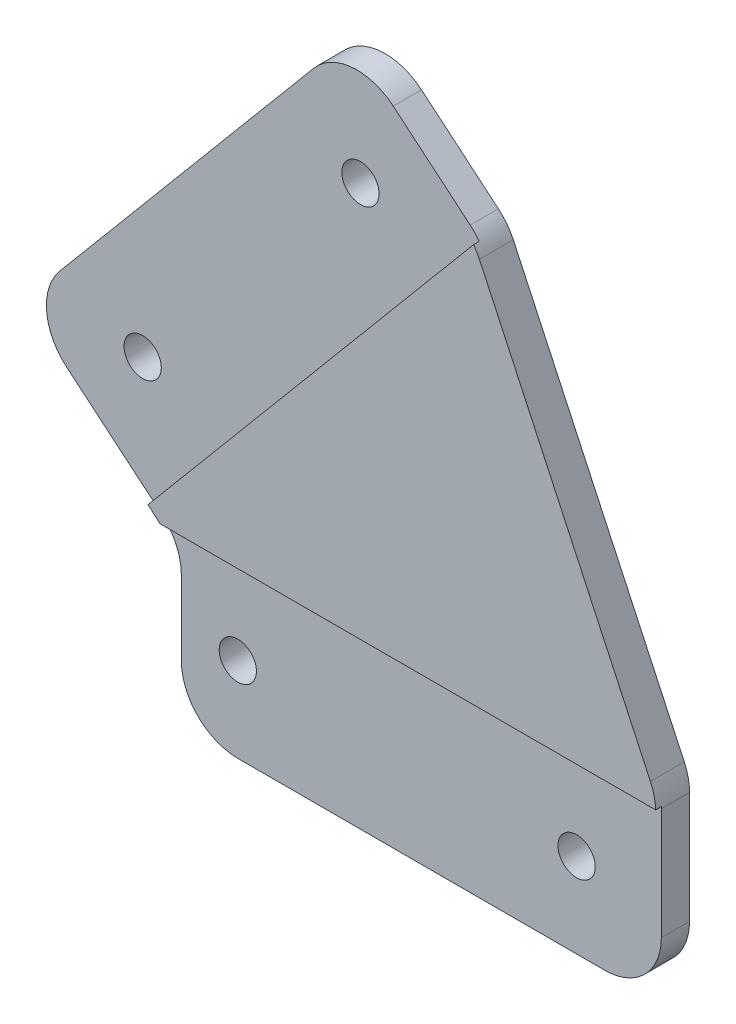
ISO-10303-21;
HEADER;
FILE_DESCRIPTION(('STEP AP214'),'2;1');
FILE_NAME('part.step','',(''),(''),'','','');
FILE_SCHEMA(('AUTOMOTIVE_DESIGN { 1 0 10303 214 1 1 1 1 }'));
ENDSEC;
DATA;
#1=APPLICATION_CONTEXT('core data for automotive mechanical design processes');
#2=APPLICATION_PROTOCOL_DEFINITION('international standard','automotive_design',2000,#1);
#3=PRODUCT_CONTEXT('',#1,'mechanical');
#4=PRODUCT('Part','Part','',(#3));
#5=PRODUCT_RELATED_PRODUCT_CATEGORY('part','',(#4));
#6=PRODUCT_DEFINITION_FORMATION('','',#4);
#7=PRODUCT_DEFINITION_CONTEXT('part definition',#1,'design');
#8=PRODUCT_DEFINITION('design','',#6,#7);
#9=PRODUCT_DEFINITION_SHAPE('','',#8);
#10=(LENGTH_UNIT() NAMED_UNIT(*) SI_UNIT(.MILLI.,.METRE.));
#11=(NAMED_UNIT(*) PLANE_ANGLE_UNIT() SI_UNIT($,.RADIAN.));
#12=(NAMED_UNIT(*) SI_UNIT($,.STERADIAN.) SOLID_ANGLE_UNIT());
#13=UNCERTAINTY_MEASURE_WITH_UNIT(LENGTH_MEASURE(1.E-05),#10,'distance_accuracy_value','');
#14=(GEOMETRIC_REPRESENTATION_CONTEXT(3) GLOBAL_UNCERTAINTY_ASSIGNED_CONTEXT((#13)) GLOBAL_UNIT_ASSIGNED_CONTEXT((#10,
#11,#12)) REPRESENTATION_CONTEXT('',''));
#15=CARTESIAN_POINT('',(0.,0.,0.));
#16=DIRECTION('',(0.,0.,1.));
#17=DIRECTION('',(1.,0.,0.));
#18=AXIS2_PLACEMENT_3D('',#15,#16,#17);
#19=CARTESIAN_POINT('',(0.,0.,3.));
#20=DIRECTION('',(0.642787609686543,0.766044443118975,0.));
#21=DIRECTION('',(-0.766044443118975,0.642787609686543,0.));
#22=AXIS2_PLACEMENT_3D('',#19,#20,#21);
#23=PLANE('',#22);
#24=DIRECTION('',(0.766044443118975,-0.642787609686543,0.));
#25=VECTOR('',#24,1.);
#26=CARTESIAN_POINT('',(0.,0.,3.));
#27=LINE('',#26,#25);
#28=CARTESIAN_POINT('',(0.038302222155933,-0.032139380484332,3.));
#29=VERTEX_POINT('',#28);
#30=CARTESIAN_POINT('',(0.713938048432714,-0.599065153123323,3.));
#31=VERTEX_POINT('',#30);
#32=EDGE_CURVE('E263',#29,#31,#27,.T.);
#33=ORIENTED_EDGE('',*,*,#32,.F.);
#34=DIRECTION('',(0.,0.,-1.));
#35=VECTOR('',#34,1.);
#36=CARTESIAN_POINT('',(0.0383022221559392,-0.0321393804843191,3.));
#37=LINE('',#36,#35);
#38=CARTESIAN_POINT('',(0.0383022221559434,-0.0321393804843154,2.5));
#39=VERTEX_POINT('',#38);
#40=EDGE_CURVE('E311',#29,#39,#37,.T.);
#41=ORIENTED_EDGE('',*,*,#40,.T.);
#42=DIRECTION('',(-0.766044443118975,0.642787609686543,0.));
#43=VECTOR('',#42,1.);
#44=CARTESIAN_POINT('',(0.,0.,2.5));
#45=LINE('',#44,#43);
#46=CARTESIAN_POINT('',(-7.66044443118975,6.42787609686543,2.5));
#47=VERTEX_POINT('',#46);
#48=EDGE_CURVE('E326',#39,#47,#45,.T.);
#49=ORIENTED_EDGE('',*,*,#48,.T.);
#50=DIRECTION('',(0.,0.,-1.));
#51=VECTOR('',#50,1.);
#52=CARTESIAN_POINT('',(-7.66044443118975,6.42787609686543,3.));
#53=LINE('',#52,#51);
#54=CARTESIAN_POINT('',(-7.66044443118975,6.42787609686543,0.));
#55=VERTEX_POINT('',#54);
#56=EDGE_CURVE('E214',#47,#55,#53,.T.);
#57=ORIENTED_EDGE('',*,*,#56,.T.);
#58=DIRECTION('',(0.766044443118975,-0.642787609686543,0.));
#59=VECTOR('',#58,1.);
#60=CARTESIAN_POINT('',(0.,0.,0.));
#61=LINE('',#60,#59);
#62=CARTESIAN_POINT('',(0.713938048432714,-0.599065153123323,0.));
#63=VERTEX_POINT('',#62);
#64=EDGE_CURVE('E299',#55,#63,#61,.T.);
#65=ORIENTED_EDGE('',*,*,#64,.T.);
#66=DIRECTION('',(0.,0.,-1.));
#67=VECTOR('',#66,1.);
#68=CARTESIAN_POINT('',(0.713938048432714,-0.599065153123323,3.));
#69=LINE('',#68,#67);
#70=EDGE_CURVE('E211',#63,#31,#69,.F.);
#71=ORIENTED_EDGE('',*,*,#70,.T.);
#72=EDGE_LOOP('',(#33,#41,#49,#57,#65,#71));
#73=FACE_BOUND('',#72,.T.);
#74=ADVANCED_FACE('F43',(#73),#23,.F.);
#75=CARTESIAN_POINT('',(2.5,0.,3.));
#76=DIRECTION('',(1.,0.,0.));
#77=DIRECTION('',(0.,1.,0.));
#78=AXIS2_PLACEMENT_3D('',#75,#76,#77);
#79=PLANE('',#78);
#80=DIRECTION('',(0.,0.,-1.));
#81=VECTOR('',#80,1.);
#82=CARTESIAN_POINT('',(2.5,-11.,3.));
#83=LINE('',#82,#81);
#84=CARTESIAN_POINT('',(2.5,-11.,0.));
#85=VERTEX_POINT('',#84);
#86=CARTESIAN_POINT('',(2.5,-11.,2.5));
#87=VERTEX_POINT('',#86);
#88=EDGE_CURVE('E223',#85,#87,#83,.F.);
#89=ORIENTED_EDGE('',*,*,#88,.T.);
#90=DIRECTION('',(0.,1.,0.));
#91=VECTOR('',#90,1.);
#92=CARTESIAN_POINT('',(2.5,0.,2.5));
#93=LINE('',#92,#91);
#94=CARTESIAN_POINT('',(2.5,-4.4292873687182,2.5));
#95=VERTEX_POINT('',#94);
#96=EDGE_CURVE('E341',#87,#95,#93,.T.);
#97=ORIENTED_EDGE('',*,*,#96,.T.);
#98=DIRECTION('',(0.,0.,-1.));
#99=VECTOR('',#98,1.);
#100=CARTESIAN_POINT('',(2.5,-4.4292873687182,0.));
#101=LINE('',#100,#99);
#102=CARTESIAN_POINT('',(2.5,-4.4292873687182,0.));
#103=VERTEX_POINT('',#102);
#104=EDGE_CURVE('E221',#95,#103,#101,.T.);
#105=ORIENTED_EDGE('',*,*,#104,.T.);
#106=DIRECTION('',(0.,-1.,0.));
#107=VECTOR('',#106,1.);
#108=CARTESIAN_POINT('',(2.5,0.,0.));
#109=LINE('',#108,#107);
#110=EDGE_CURVE('E296',#103,#85,#109,.T.);
#111=ORIENTED_EDGE('',*,*,#110,.T.);
#112=EDGE_LOOP('',(#89,#97,#105,#111));
#113=FACE_BOUND('',#112,.T.);
#114=ADVANCED_FACE('F372',(#113),#79,.F.);
#115=CARTESIAN_POINT('',(0.,-16.,3.));
#116=DIRECTION('',(0.,1.,0.));
#117=DIRECTION('',(0.,0.,1.));
#118=AXIS2_PLACEMENT_3D('',#115,#116,#117);
#119=PLANE('',#118);
#120=DIRECTION('',(0.,0.,-1.));
#121=VECTOR('',#120,1.);
#122=CARTESIAN_POINT('',(40.,-16.,3.));
#123=LINE('',#122,#121);
#124=CARTESIAN_POINT('',(40.,-16.,0.));
#125=VERTEX_POINT('',#124);
#126=CARTESIAN_POINT('',(40.,-16.,2.5));
#127=VERTEX_POINT('',#126);
#128=EDGE_CURVE('E208',#125,#127,#123,.F.);
#129=ORIENTED_EDGE('',*,*,#128,.T.);
#130=DIRECTION('',(1.,0.,0.));
#131=VECTOR('',#130,1.);
#132=CARTESIAN_POINT('',(0.5,-16.,2.5));
#133=LINE('',#132,#131);
#134=CARTESIAN_POINT('',(7.5,-16.,2.5));
#135=VERTEX_POINT('',#134);
#136=EDGE_CURVE('E187',#135,#127,#133,.T.);
#137=ORIENTED_EDGE('',*,*,#136,.F.);
#138=DIRECTION('',(0.,0.,-1.));
#139=VECTOR('',#138,1.);
#140=CARTESIAN_POINT('',(7.5,-16.,3.));
#141=LINE('',#140,#139);
#142=CARTESIAN_POINT('',(7.5,-16.,0.));
#143=VERTEX_POINT('',#142);
#144=EDGE_CURVE('E206',#135,#143,#141,.T.);
#145=ORIENTED_EDGE('',*,*,#144,.T.);
#146=DIRECTION('',(1.,0.,0.));
#147=VECTOR('',#146,1.);
#148=CARTESIAN_POINT('',(0.,-16.,0.));
#149=LINE('',#148,#147);
#150=EDGE_CURVE('E291',#143,#125,#149,.T.);
#151=ORIENTED_EDGE('',*,*,#150,.T.);
#152=EDGE_LOOP('',(#129,#137,#145,#151));
#153=FACE_BOUND('',#152,.T.);
#154=ADVANCED_FACE('F379',(#153),#119,.F.);
#155=CARTESIAN_POINT('',(45.,0.,3.));
#156=DIRECTION('',(-1.,0.,0.));
#157=DIRECTION('',(0.,0.,1.));
#158=AXIS2_PLACEMENT_3D('',#155,#156,#157);
#159=PLANE('',#158);
#160=DIRECTION('',(0.,0.,-1.));
#161=VECTOR('',#160,1.);
#162=CARTESIAN_POINT('',(45.,-1.10847331321474,3.));
#163=LINE('',#162,#161);
#164=CARTESIAN_POINT('',(45.,-1.10847331321474,0.));
#165=VERTEX_POINT('',#164);
#166=CARTESIAN_POINT('',(45.,-1.10847331321474,2.5));
#167=VERTEX_POINT('',#166);
#168=EDGE_CURVE('E203',#165,#167,#163,.F.);
#169=ORIENTED_EDGE('',*,*,#168,.T.);
#170=DIRECTION('',(0.,1.,0.));
#171=VECTOR('',#170,1.);
#172=CARTESIAN_POINT('',(45.,-16.,2.5));
#173=LINE('',#172,#171);
#174=CARTESIAN_POINT('',(45.,-11.,2.5));
#175=VERTEX_POINT('',#174);
#176=EDGE_CURVE('E345',#175,#167,#173,.T.);
#177=ORIENTED_EDGE('',*,*,#176,.F.);
#178=DIRECTION('',(0.,0.,-1.));
#179=VECTOR('',#178,1.);
#180=CARTESIAN_POINT('',(45.,-11.,3.));
#181=LINE('',#180,#179);
#182=CARTESIAN_POINT('',(45.,-11.,0.));
#183=VERTEX_POINT('',#182);
#184=EDGE_CURVE('E197',#175,#183,#181,.T.);
#185=ORIENTED_EDGE('',*,*,#184,.T.);
#186=DIRECTION('',(0.,1.,0.));
#187=VECTOR('',#186,1.);
#188=CARTESIAN_POINT('',(45.,0.,0.));
#189=LINE('',#188,#187);
#190=EDGE_CURVE('E290',#183,#165,#189,.T.);
#191=ORIENTED_EDGE('',*,*,#190,.T.);
#192=EDGE_LOOP('',(#169,#177,#185,#191));
#193=FACE_BOUND('',#192,.T.);
#194=ADVANCED_FACE('F369',(#193),#159,.F.);
#195=CARTESIAN_POINT('',(36.9627212179472,17.2359999701769,3.));
#196=DIRECTION('',(-0.906307787036651,-0.422618261740697,0.));
#197=DIRECTION('',(0.422618261740697,-0.906307787036651,0.));
#198=AXIS2_PLACEMENT_3D('',#195,#196,#197);
#199=PLANE('',#198);
#200=DIRECTION('',(-0.422618261740697,0.906307787036651,0.));
#201=VECTOR('',#200,1.);
#202=CARTESIAN_POINT('',(36.9627212179472,17.2359999701769,0.));
#203=LINE('',#202,#201);
#204=CARTESIAN_POINT('',(44.5315389351833,1.00461799548874,0.));
#205=VERTEX_POINT('',#204);
#206=CARTESIAN_POINT('',(29.3939035007112,33.4673819448651,0.));
#207=VERTEX_POINT('',#206);
#208=EDGE_CURVE('E268',#205,#207,#203,.T.);
#209=ORIENTED_EDGE('',*,*,#208,.T.);
#210=DIRECTION('',(0.,0.,-1.));
#211=VECTOR('',#210,1.);
#212=CARTESIAN_POINT('',(29.3939035007112,33.4673819448651,3.));
#213=LINE('',#212,#211);
#214=CARTESIAN_POINT('',(29.3939035007112,33.4673819448651,3.));
#215=VERTEX_POINT('',#214);
#216=EDGE_CURVE('E194',#207,#215,#213,.F.);
#217=ORIENTED_EDGE('',*,*,#216,.T.);
#218=DIRECTION('',(-0.422618261740697,0.906307787036651,0.));
#219=VECTOR('',#218,1.);
#220=CARTESIAN_POINT('',(36.9627212179472,17.2359999701769,3.));
#221=LINE('',#220,#219);
#222=CARTESIAN_POINT('',(44.5315389351833,1.00461799548874,3.));
#223=VERTEX_POINT('',#222);
#224=EDGE_CURVE('E266',#223,#215,#221,.T.);
#225=ORIENTED_EDGE('',*,*,#224,.F.);
#226=DIRECTION('',(0.,0.,-1.));
#227=VECTOR('',#226,1.);
#228=CARTESIAN_POINT('',(44.5315389351833,1.00461799548874,3.));
#229=LINE('',#228,#227);
#230=EDGE_CURVE('E192',#223,#205,#229,.T.);
#231=ORIENTED_EDGE('',*,*,#230,.T.);
#232=EDGE_LOOP('',(#209,#217,#225,#231));
#233=FACE_BOUND('',#232,.T.);
#234=ADVANCED_FACE('F285',(#233),#199,.F.);
#235=CARTESIAN_POINT('',(28.9254424358944,34.4719999403539,3.));
#236=DIRECTION('',(-0.642787609686543,-0.766044443118975,0.));
#237=DIRECTION('',(0.766044443118975,-0.642787609686543,0.));
#238=AXIS2_PLACEMENT_3D('',#235,#236,#237);
#239=PLANE('',#238);
#240=DIRECTION('',(0.,0.,-1.));
#241=VECTOR('',#240,1.);
#242=CARTESIAN_POINT('',(21.2649980047047,40.8998760372193,3.));
#243=LINE('',#242,#241);
#244=CARTESIAN_POINT('',(21.2649980047047,40.8998760372193,0.));
#245=VERTEX_POINT('',#244);
#246=CARTESIAN_POINT('',(21.2649980047047,40.8998760372193,2.5));
#247=VERTEX_POINT('',#246);
#248=EDGE_CURVE('E252',#245,#247,#243,.F.);
#249=ORIENTED_EDGE('',*,*,#248,.T.);
#250=DIRECTION('',(-0.766044443118974,0.642787609686543,0.));
#251=VECTOR('',#250,1.);
#252=CARTESIAN_POINT('',(17.4347757891098,44.113814085652,2.5));
#253=LINE('',#252,#251);
#254=CARTESIAN_POINT('',(28.0763026139607,35.1845128517564,2.5));
#255=VERTEX_POINT('',#254);
#256=EDGE_CURVE('E58',#255,#247,#253,.T.);
#257=ORIENTED_EDGE('',*,*,#256,.F.);
#258=DIRECTION('',(0.,0.,-1.));
#259=VECTOR('',#258,1.);
#260=CARTESIAN_POINT('',(28.0763026139607,35.1845128517564,3.));
#261=LINE('',#260,#259);
#262=CARTESIAN_POINT('',(28.0763026139607,35.1845128517564,0.));
#263=VERTEX_POINT('',#262);
#264=EDGE_CURVE('E273',#255,#263,#261,.T.);
#265=ORIENTED_EDGE('',*,*,#264,.T.);
#266=DIRECTION('',(-0.766044443118975,0.642787609686543,0.));
#267=VECTOR('',#266,1.);
#268=CARTESIAN_POINT('',(28.9254424358944,34.4719999403539,0.));
#269=LINE('',#268,#267);
#270=EDGE_CURVE('E264',#263,#245,#269,.T.);
#271=ORIENTED_EDGE('',*,*,#270,.T.);
#272=EDGE_LOOP('',(#249,#257,#265,#271));
#273=FACE_BOUND('',#272,.T.);
#274=ADVANCED_FACE('F360',(#273),#239,.F.);
#275=CARTESIAN_POINT('',(-11.4906666467846,9.64181414529815,3.));
#276=DIRECTION('',(0.766044443118975,-0.642787609686543,0.));
#277=DIRECTION('',(0.642787609686543,0.766044443118975,0.));
#278=AXIS2_PLACEMENT_3D('',#275,#276,#277);
#279=PLANE('',#278);
#280=DIRECTION('',(0.,0.,-1.));
#281=VECTOR('',#280,1.);
#282=CARTESIAN_POINT('',(-8.27672859835191,13.472036360893,3.));
#283=LINE('',#282,#281);
#284=CARTESIAN_POINT('',(-8.27672859835191,13.472036360893,0.));
#285=VERTEX_POINT('',#284);
#286=CARTESIAN_POINT('',(-8.27672859835191,13.472036360893,2.5));
#287=VERTEX_POINT('',#286);
#288=EDGE_CURVE('E218',#285,#287,#283,.F.);
#289=ORIENTED_EDGE('',*,*,#288,.T.);
#290=DIRECTION('',(-0.642787609686543,-0.766044443118975,0.));
#291=VECTOR('',#290,1.);
#292=CARTESIAN_POINT('',(17.4347757891098,44.113814085652,2.5));
#293=LINE('',#292,#291);
#294=CARTESIAN_POINT('',(14.2208377406771,40.2835918700571,2.5));
#295=VERTEX_POINT('',#294);
#296=EDGE_CURVE('E236',#295,#287,#293,.T.);
#297=ORIENTED_EDGE('',*,*,#296,.F.);
#298=DIRECTION('',(0.,0.,-1.));
#299=VECTOR('',#298,1.);
#300=CARTESIAN_POINT('',(14.2208377406771,40.2835918700571,3.));
#301=LINE('',#300,#299);
#302=CARTESIAN_POINT('',(14.2208377406771,40.2835918700571,0.));
#303=VERTEX_POINT('',#302);
#304=EDGE_CURVE('E216',#295,#303,#301,.T.);
#305=ORIENTED_EDGE('',*,*,#304,.T.);
#306=DIRECTION('',(-0.642787609686543,-0.766044443118975,0.));
#307=VECTOR('',#306,1.);
#308=CARTESIAN_POINT('',(-11.4906666467846,9.64181414529815,0.));
#309=LINE('',#308,#307);
#310=EDGE_CURVE('E259',#303,#285,#309,.T.);
#311=ORIENTED_EDGE('',*,*,#310,.T.);
#312=EDGE_LOOP('',(#289,#297,#305,#311));
#313=FACE_BOUND('',#312,.T.);
#314=ADVANCED_FACE('F243',(#313),#279,.F.);
#315=CARTESIAN_POINT('',(0.,0.,3.));
#316=DIRECTION('',(0.,0.,1.));
#317=DIRECTION('',(1.,0.,0.));
#318=AXIS2_PLACEMENT_3D('',#315,#316,#317);
#319=PLANE('',#318);
#320=DIRECTION('',(0.642787609686543,0.766044443118975,0.));
#321=VECTOR('',#320,1.);
#322=CARTESIAN_POINT('',(28.9637446580504,34.4398605598695,3.));
#323=LINE('',#322,#321);
#324=CARTESIAN_POINT('',(28.8762887770626,34.3356346995088,3.));
#325=VERTEX_POINT('',#324);
#326=EDGE_CURVE('E186',#29,#325,#323,.T.);
#327=ORIENTED_EDGE('',*,*,#326,.F.);
#328=ORIENTED_EDGE('',*,*,#32,.T.);
#329=CARTESIAN_POINT('',(-2.5,-4.4292873687182,3.));
#330=DIRECTION('',(0.,0.,1.));
#331=DIRECTION('',(1.,0.,0.));
#332=AXIS2_PLACEMENT_3D('',#329,#330,#331);
#333=CIRCLE('',#332,5.);
#334=CARTESIAN_POINT('',(1.0908995260071,-0.950000000000002,3.));
#335=VERTEX_POINT('',#334);
#336=EDGE_CURVE('E185',#31,#335,#333,.F.);
#337=ORIENTED_EDGE('',*,*,#336,.T.);
#338=DIRECTION('',(-1.,0.,0.));
#339=VECTOR('',#338,1.);
#340=CARTESIAN_POINT('',(0.499999999999997,-0.950000000000002,3.));
#341=LINE('',#340,#339);
#342=CARTESIAN_POINT('',(44.9974879898804,-0.95,3.));
#343=VERTEX_POINT('',#342);
#344=EDGE_CURVE('E169',#343,#335,#341,.T.);
#345=ORIENTED_EDGE('',*,*,#344,.F.);
#346=CARTESIAN_POINT('',(40.,-1.10847331321474,3.));
#347=DIRECTION('',(0.,0.,1.));
#348=DIRECTION('',(1.,0.,0.));
#349=AXIS2_PLACEMENT_3D('',#346,#347,#348);
#350=CIRCLE('',#349,5.);
#351=EDGE_CURVE('E182',#343,#223,#350,.T.);
#352=ORIENTED_EDGE('',*,*,#351,.T.);
#353=ORIENTED_EDGE('',*,*,#224,.T.);
#354=CARTESIAN_POINT('',(24.8623645655279,31.3542906361616,3.));
#355=DIRECTION('',(0.,0.,1.));
#356=DIRECTION('',(1.,0.,0.));
#357=AXIS2_PLACEMENT_3D('',#354,#355,#356);
#358=CIRCLE('',#357,5.);
#359=EDGE_CURVE('E193',#215,#325,#358,.T.);
#360=ORIENTED_EDGE('',*,*,#359,.T.);
#361=EDGE_LOOP('',(#327,#328,#337,#345,#352,#353,#360));
#362=FACE_BOUND('',#361,.T.);
#363=ADVANCED_FACE('F180',(#362),#319,.T.);
#364=CARTESIAN_POINT('',(0.,0.,0.));
#365=DIRECTION('',(0.,0.,1.));
#366=DIRECTION('',(1.,0.,0.));
#367=AXIS2_PLACEMENT_3D('',#364,#365,#366);
#368=PLANE('',#367);
#369=CARTESIAN_POINT('',(37.5,-8.5,0.));
#370=DIRECTION('',(0.,0.,1.));
#371=DIRECTION('',(1.,0.,0.));
#372=AXIS2_PLACEMENT_3D('',#369,#370,#371);
#373=CIRCLE('',#372,1.65);
#374=CARTESIAN_POINT('',(39.15,-8.5,0.));
#375=VERTEX_POINT('',#374);
#376=EDGE_CURVE('E307',#375,#375,#373,.T.);
#377=ORIENTED_EDGE('',*,*,#376,.T.);
#378=EDGE_LOOP('',(#377));
#379=FACE_BOUND('',#378,.T.);
#380=CARTESIAN_POINT('',(18.359202039853,33.5475736896106,0.));
#381=DIRECTION('',(0.,0.,1.));
#382=DIRECTION('',(1.,0.,0.));
#383=AXIS2_PLACEMENT_3D('',#380,#381,#382);
#384=CIRCLE('',#383,1.65);
#385=CARTESIAN_POINT('',(20.009202039853,33.5475736896106,0.));
#386=VERTEX_POINT('',#385);
#387=EDGE_CURVE('E310',#386,#386,#384,.T.);
#388=ORIENTED_EDGE('',*,*,#387,.T.);
#389=EDGE_LOOP('',(#388));
#390=FACE_BOUND('',#389,.T.);
#391=CARTESIAN_POINT('',(-0.924426250743252,10.5662403960414,0.));
#392=DIRECTION('',(0.,0.,1.));
#393=DIRECTION('',(1.,0.,0.));
#394=AXIS2_PLACEMENT_3D('',#391,#392,#393);
#395=CIRCLE('',#394,1.65);
#396=CARTESIAN_POINT('',(0.725573749256749,10.5662403960414,0.));
#397=VERTEX_POINT('',#396);
#398=EDGE_CURVE('E306',#397,#397,#395,.T.);
#399=ORIENTED_EDGE('',*,*,#398,.T.);
#400=EDGE_LOOP('',(#399));
#401=FACE_BOUND('',#400,.T.);
#402=CARTESIAN_POINT('',(7.5,-8.5,0.));
#403=DIRECTION('',(0.,0.,1.));
#404=DIRECTION('',(1.,0.,0.));
#405=AXIS2_PLACEMENT_3D('',#402,#403,#404);
#406=CIRCLE('',#405,1.65);
#407=CARTESIAN_POINT('',(9.15,-8.5,0.));
#408=VERTEX_POINT('',#407);
#409=EDGE_CURVE('E302',#408,#408,#406,.T.);
#410=ORIENTED_EDGE('',*,*,#409,.T.);
#411=EDGE_LOOP('',(#410));
#412=FACE_BOUND('',#411,.T.);
#413=ORIENTED_EDGE('',*,*,#270,.F.);
#414=CARTESIAN_POINT('',(24.8623645655279,31.3542906361616,0.));
#415=DIRECTION('',(0.,0.,1.));
#416=DIRECTION('',(1.,0.,0.));
#417=AXIS2_PLACEMENT_3D('',#414,#415,#416);
#418=CIRCLE('',#417,5.);
#419=EDGE_CURVE('E281',#263,#207,#418,.F.);
#420=ORIENTED_EDGE('',*,*,#419,.T.);
#421=ORIENTED_EDGE('',*,*,#208,.F.);
#422=CARTESIAN_POINT('',(40.,-1.10847331321474,0.));
#423=DIRECTION('',(0.,0.,1.));
#424=DIRECTION('',(1.,0.,0.));
#425=AXIS2_PLACEMENT_3D('',#422,#423,#424);
#426=CIRCLE('',#425,5.);
#427=EDGE_CURVE('E279',#205,#165,#426,.F.);
#428=ORIENTED_EDGE('',*,*,#427,.T.);
#429=ORIENTED_EDGE('',*,*,#190,.F.);
#430=CARTESIAN_POINT('',(40.,-11.,0.));
#431=DIRECTION('',(0.,0.,1.));
#432=DIRECTION('',(1.,0.,0.));
#433=AXIS2_PLACEMENT_3D('',#430,#431,#432);
#434=CIRCLE('',#433,5.);
#435=EDGE_CURVE('E277',#183,#125,#434,.F.);
#436=ORIENTED_EDGE('',*,*,#435,.T.);
#437=ORIENTED_EDGE('',*,*,#150,.F.);
#438=CARTESIAN_POINT('',(7.5,-11.,0.));
#439=DIRECTION('',(0.,0.,1.));
#440=DIRECTION('',(1.,0.,0.));
#441=AXIS2_PLACEMENT_3D('',#438,#439,#440);
#442=CIRCLE('',#441,5.);
#443=EDGE_CURVE('E257',#143,#85,#442,.F.);
#444=ORIENTED_EDGE('',*,*,#443,.T.);
#445=ORIENTED_EDGE('',*,*,#110,.F.);
#446=CARTESIAN_POINT('',(-2.5,-4.4292873687182,0.));
#447=DIRECTION('',(0.,0.,1.));
#448=DIRECTION('',(1.,0.,0.));
#449=AXIS2_PLACEMENT_3D('',#446,#447,#448);
#450=CIRCLE('',#449,5.);
#451=EDGE_CURVE('E226',#103,#63,#450,.T.);
#452=ORIENTED_EDGE('',*,*,#451,.T.);
#453=ORIENTED_EDGE('',*,*,#64,.F.);
#454=CARTESIAN_POINT('',(-4.44650638275704,10.2580983124603,0.));
#455=DIRECTION('',(0.,0.,1.));
#456=DIRECTION('',(1.,0.,0.));
#457=AXIS2_PLACEMENT_3D('',#454,#455,#456);
#458=CIRCLE('',#457,5.);
#459=EDGE_CURVE('E256',#55,#285,#458,.F.);
#460=ORIENTED_EDGE('',*,*,#459,.T.);
#461=ORIENTED_EDGE('',*,*,#310,.F.);
#462=CARTESIAN_POINT('',(18.051059956272,37.0696538216244,0.));
#463=DIRECTION('',(0.,0.,1.));
#464=DIRECTION('',(1.,0.,0.));
#465=AXIS2_PLACEMENT_3D('',#462,#463,#464);
#466=CIRCLE('',#465,5.);
#467=EDGE_CURVE('E250',#303,#245,#466,.F.);
#468=ORIENTED_EDGE('',*,*,#467,.T.);
#469=EDGE_LOOP('',(#413,#420,#421,#428,#429,#436,#437,#444,#445,#452,#453,#460,#461,#468));
#470=FACE_BOUND('',#469,.T.);
#471=ADVANCED_FACE('F260',(#379,#390,#401,#412,#470),#368,.F.);
#472=CARTESIAN_POINT('',(7.5,-8.5,0.));
#473=DIRECTION('',(0.,0.,1.));
#474=DIRECTION('',(1.,0.,0.));
#475=AXIS2_PLACEMENT_3D('',#472,#473,#474);
#476=CYLINDRICAL_SURFACE('',#475,1.65);
#477=CARTESIAN_POINT('',(7.5,-8.5,2.5));
#478=DIRECTION('',(0.,0.,-1.));
#479=DIRECTION('',(-1.,0.,0.));
#480=AXIS2_PLACEMENT_3D('',#477,#478,#479);
#481=CIRCLE('',#480,1.65);
#482=CARTESIAN_POINT('',(5.85,-8.5,2.5));
#483=VERTEX_POINT('',#482);
#484=EDGE_CURVE('E175',#483,#483,#481,.F.);
#485=ORIENTED_EDGE('',*,*,#484,.T.);
#486=EDGE_LOOP('',(#485));
#487=FACE_BOUND('',#486,.T.);
#488=ORIENTED_EDGE('',*,*,#409,.F.);
#489=EDGE_LOOP('',(#488));
#490=FACE_BOUND('',#489,.T.);
#491=ADVANCED_FACE('F477',(#487,#490),#476,.F.);
#492=CARTESIAN_POINT('',(-0.924426250743252,10.5662403960414,0.));
#493=DIRECTION('',(0.,0.,1.));
#494=DIRECTION('',(1.,0.,0.));
#495=AXIS2_PLACEMENT_3D('',#492,#493,#494);
#496=CYLINDRICAL_SURFACE('',#495,1.65);
#497=CARTESIAN_POINT('',(-0.924426250743252,10.5662403960414,2.5));
#498=DIRECTION('',(0.,0.,-1.));
#499=DIRECTION('',(-1.,0.,0.));
#500=AXIS2_PLACEMENT_3D('',#497,#498,#499);
#501=CIRCLE('',#500,1.65);
#502=CARTESIAN_POINT('',(-2.57442625074325,10.5662403960414,2.5));
#503=VERTEX_POINT('',#502);
#504=EDGE_CURVE('E318',#503,#503,#501,.F.);
#505=ORIENTED_EDGE('',*,*,#504,.T.);
#506=EDGE_LOOP('',(#505));
#507=FACE_BOUND('',#506,.T.);
#508=ORIENTED_EDGE('',*,*,#398,.F.);
#509=EDGE_LOOP('',(#508));
#510=FACE_BOUND('',#509,.T.);
#511=ADVANCED_FACE('F486',(#507,#510),#496,.F.);
#512=CARTESIAN_POINT('',(18.359202039853,33.5475736896106,0.));
#513=DIRECTION('',(0.,0.,1.));
#514=DIRECTION('',(1.,0.,0.));
#515=AXIS2_PLACEMENT_3D('',#512,#513,#514);
#516=CYLINDRICAL_SURFACE('',#515,1.65);
#517=CARTESIAN_POINT('',(18.359202039853,33.5475736896106,2.5));
#518=DIRECTION('',(0.,0.,-1.));
#519=DIRECTION('',(-1.,0.,0.));
#520=AXIS2_PLACEMENT_3D('',#517,#518,#519);
#521=CIRCLE('',#520,1.65);
#522=CARTESIAN_POINT('',(16.709202039853,33.5475736896106,2.5));
#523=VERTEX_POINT('',#522);
#524=EDGE_CURVE('E321',#523,#523,#521,.F.);
#525=ORIENTED_EDGE('',*,*,#524,.T.);
#526=EDGE_LOOP('',(#525));
#527=FACE_BOUND('',#526,.T.);
#528=ORIENTED_EDGE('',*,*,#387,.F.);
#529=EDGE_LOOP('',(#528));
#530=FACE_BOUND('',#529,.T.);
#531=ADVANCED_FACE('F495',(#527,#530),#516,.F.);
#532=CARTESIAN_POINT('',(37.5,-8.5,0.));
#533=DIRECTION('',(0.,0.,1.));
#534=DIRECTION('',(1.,0.,0.));
#535=AXIS2_PLACEMENT_3D('',#532,#533,#534);
#536=CYLINDRICAL_SURFACE('',#535,1.65);
#537=CARTESIAN_POINT('',(37.5,-8.5,2.5));
#538=DIRECTION('',(0.,0.,-1.));
#539=DIRECTION('',(-1.,0.,0.));
#540=AXIS2_PLACEMENT_3D('',#537,#538,#539);
#541=CIRCLE('',#540,1.65);
#542=CARTESIAN_POINT('',(35.85,-8.5,2.5));
#543=VERTEX_POINT('',#542);
#544=EDGE_CURVE('E332',#543,#543,#541,.F.);
#545=ORIENTED_EDGE('',*,*,#544,.T.);
#546=EDGE_LOOP('',(#545));
#547=FACE_BOUND('',#546,.T.);
#548=ORIENTED_EDGE('',*,*,#376,.F.);
#549=EDGE_LOOP('',(#548));
#550=FACE_BOUND('',#549,.T.);
#551=ADVANCED_FACE('F387',(#547,#550),#536,.F.);
#552=CARTESIAN_POINT('',(24.8623645655279,31.3542906361616,3.));
#553=DIRECTION('',(0.,0.,-1.));
#554=DIRECTION('',(-1.,0.,0.));
#555=AXIS2_PLACEMENT_3D('',#552,#553,#554);
#556=CYLINDRICAL_SURFACE('',#555,5.);
#557=DIRECTION('',(0.,0.,-1.));
#558=VECTOR('',#557,1.);
#559=CARTESIAN_POINT('',(28.8762887770626,34.3356346995088,3.));
#560=LINE('',#559,#558);
#561=CARTESIAN_POINT('',(28.8762887770626,34.3356346995088,2.5));
#562=VERTEX_POINT('',#561);
#563=EDGE_CURVE('E11',#325,#562,#560,.T.);
#564=ORIENTED_EDGE('',*,*,#563,.F.);
#565=ORIENTED_EDGE('',*,*,#359,.F.);
#566=ORIENTED_EDGE('',*,*,#216,.F.);
#567=ORIENTED_EDGE('',*,*,#419,.F.);
#568=ORIENTED_EDGE('',*,*,#264,.F.);
#569=CARTESIAN_POINT('',(24.8623645655279,31.3542906361616,2.5));
#570=DIRECTION('',(0.,0.,-1.));
#571=DIRECTION('',(-1.,0.,0.));
#572=AXIS2_PLACEMENT_3D('',#569,#570,#571);
#573=CIRCLE('',#572,5.);
#574=EDGE_CURVE('E324',#562,#255,#573,.F.);
#575=ORIENTED_EDGE('',*,*,#574,.F.);
#576=EDGE_LOOP('',(#564,#565,#566,#567,#568,#575));
#577=FACE_BOUND('',#576,.T.);
#578=ADVANCED_FACE('F357',(#577),#556,.T.);
#579=CARTESIAN_POINT('',(40.,-1.10847331321474,3.));
#580=DIRECTION('',(0.,0.,-1.));
#581=DIRECTION('',(-1.,0.,0.));
#582=AXIS2_PLACEMENT_3D('',#579,#580,#581);
#583=CYLINDRICAL_SURFACE('',#582,5.);
#584=DIRECTION('',(0.,0.,-1.));
#585=VECTOR('',#584,1.);
#586=CARTESIAN_POINT('',(44.9974879898804,-0.95,3.));
#587=LINE('',#586,#585);
#588=CARTESIAN_POINT('',(44.9974879898804,-0.95,2.5));
#589=VERTEX_POINT('',#588);
#590=EDGE_CURVE('E166',#589,#343,#587,.F.);
#591=ORIENTED_EDGE('',*,*,#590,.F.);
#592=CARTESIAN_POINT('',(40.,-1.10847331321474,2.5));
#593=DIRECTION('',(0.,0.,-1.));
#594=DIRECTION('',(-1.,0.,0.));
#595=AXIS2_PLACEMENT_3D('',#592,#593,#594);
#596=CIRCLE('',#595,5.);
#597=EDGE_CURVE('E335',#167,#589,#596,.F.);
#598=ORIENTED_EDGE('',*,*,#597,.F.);
#599=ORIENTED_EDGE('',*,*,#168,.F.);
#600=ORIENTED_EDGE('',*,*,#427,.F.);
#601=ORIENTED_EDGE('',*,*,#230,.F.);
#602=ORIENTED_EDGE('',*,*,#351,.F.);
#603=EDGE_LOOP('',(#591,#598,#599,#600,#601,#602));
#604=FACE_BOUND('',#603,.T.);
#605=ADVANCED_FACE('F190',(#604),#583,.T.);
#606=CARTESIAN_POINT('',(40.,-11.,3.));
#607=DIRECTION('',(0.,0.,-1.));
#608=DIRECTION('',(-1.,0.,0.));
#609=AXIS2_PLACEMENT_3D('',#606,#607,#608);
#610=CYLINDRICAL_SURFACE('',#609,5.);
#611=CARTESIAN_POINT('',(40.,-11.,2.5));
#612=DIRECTION('',(0.,0.,-1.));
#613=DIRECTION('',(-1.,0.,0.));
#614=AXIS2_PLACEMENT_3D('',#611,#612,#613);
#615=CIRCLE('',#614,5.);
#616=EDGE_CURVE('E337',#127,#175,#615,.F.);
#617=ORIENTED_EDGE('',*,*,#616,.F.);
#618=ORIENTED_EDGE('',*,*,#128,.F.);
#619=ORIENTED_EDGE('',*,*,#435,.F.);
#620=ORIENTED_EDGE('',*,*,#184,.F.);
#621=EDGE_LOOP('',(#617,#618,#619,#620));
#622=FACE_BOUND('',#621,.T.);
#623=ADVANCED_FACE('F390',(#622),#610,.T.);
#624=CARTESIAN_POINT('',(-4.44650638275704,10.2580983124603,3.));
#625=DIRECTION('',(0.,0.,-1.));
#626=DIRECTION('',(-1.,0.,0.));
#627=AXIS2_PLACEMENT_3D('',#624,#625,#626);
#628=CYLINDRICAL_SURFACE('',#627,5.);
#629=CARTESIAN_POINT('',(-4.44650638275704,10.2580983124603,2.5));
#630=DIRECTION('',(0.,0.,-1.));
#631=DIRECTION('',(-1.,0.,0.));
#632=AXIS2_PLACEMENT_3D('',#629,#630,#631);
#633=CIRCLE('',#632,5.);
#634=EDGE_CURVE('E174',#287,#47,#633,.F.);
#635=ORIENTED_EDGE('',*,*,#634,.F.);
#636=ORIENTED_EDGE('',*,*,#288,.F.);
#637=ORIENTED_EDGE('',*,*,#459,.F.);
#638=ORIENTED_EDGE('',*,*,#56,.F.);
#639=EDGE_LOOP('',(#635,#636,#637,#638));
#640=FACE_BOUND('',#639,.T.);
#641=ADVANCED_FACE('F393',(#640),#628,.T.);
#642=CARTESIAN_POINT('',(18.051059956272,37.0696538216244,3.));
#643=DIRECTION('',(0.,0.,-1.));
#644=DIRECTION('',(-1.,0.,0.));
#645=AXIS2_PLACEMENT_3D('',#642,#643,#644);
#646=CYLINDRICAL_SURFACE('',#645,5.);
#647=CARTESIAN_POINT('',(18.051059956272,37.0696538216244,2.5));
#648=DIRECTION('',(0.,0.,-1.));
#649=DIRECTION('',(-1.,0.,0.));
#650=AXIS2_PLACEMENT_3D('',#647,#648,#649);
#651=CIRCLE('',#650,5.);
#652=EDGE_CURVE('E51',#247,#295,#651,.F.);
#653=ORIENTED_EDGE('',*,*,#652,.F.);
#654=ORIENTED_EDGE('',*,*,#248,.F.);
#655=ORIENTED_EDGE('',*,*,#467,.F.);
#656=ORIENTED_EDGE('',*,*,#304,.F.);
#657=EDGE_LOOP('',(#653,#654,#655,#656));
#658=FACE_BOUND('',#657,.T.);
#659=ADVANCED_FACE('F249',(#658),#646,.T.);
#660=CARTESIAN_POINT('',(7.5,-11.,3.));
#661=DIRECTION('',(0.,0.,-1.));
#662=DIRECTION('',(-1.,0.,0.));
#663=AXIS2_PLACEMENT_3D('',#660,#661,#662);
#664=CYLINDRICAL_SURFACE('',#663,5.);
#665=CARTESIAN_POINT('',(7.5,-11.,2.5));
#666=DIRECTION('',(0.,0.,-1.));
#667=DIRECTION('',(-1.,0.,0.));
#668=AXIS2_PLACEMENT_3D('',#665,#666,#667);
#669=CIRCLE('',#668,5.);
#670=EDGE_CURVE('E339',#87,#135,#669,.F.);
#671=ORIENTED_EDGE('',*,*,#670,.F.);
#672=ORIENTED_EDGE('',*,*,#88,.F.);
#673=ORIENTED_EDGE('',*,*,#443,.F.);
#674=ORIENTED_EDGE('',*,*,#144,.F.);
#675=EDGE_LOOP('',(#671,#672,#673,#674));
#676=FACE_BOUND('',#675,.T.);
#677=ADVANCED_FACE('F399',(#676),#664,.T.);
#678=CARTESIAN_POINT('',(-2.5,-4.4292873687182,3.));
#679=DIRECTION('',(0.,0.,1.));
#680=DIRECTION('',(1.,0.,0.));
#681=AXIS2_PLACEMENT_3D('',#678,#679,#680);
#682=CYLINDRICAL_SURFACE('',#681,5.);
#683=CARTESIAN_POINT('',(-2.5,-4.4292873687182,2.5));
#684=DIRECTION('',(0.,0.,-1.));
#685=DIRECTION('',(-1.,0.,0.));
#686=AXIS2_PLACEMENT_3D('',#683,#684,#685);
#687=CIRCLE('',#686,5.);
#688=CARTESIAN_POINT('',(1.0908995260071,-0.950000000000002,2.5));
#689=VERTEX_POINT('',#688);
#690=EDGE_CURVE('E229',#95,#689,#687,.F.);
#691=ORIENTED_EDGE('',*,*,#690,.T.);
#692=DIRECTION('',(0.,0.,1.));
#693=VECTOR('',#692,1.);
#694=CARTESIAN_POINT('',(1.0908995260071,-0.950000000000002,3.));
#695=LINE('',#694,#693);
#696=EDGE_CURVE('E232',#689,#335,#695,.T.);
#697=ORIENTED_EDGE('',*,*,#696,.T.);
#698=ORIENTED_EDGE('',*,*,#336,.F.);
#699=ORIENTED_EDGE('',*,*,#70,.F.);
#700=ORIENTED_EDGE('',*,*,#451,.F.);
#701=ORIENTED_EDGE('',*,*,#104,.F.);
#702=EDGE_LOOP('',(#691,#697,#698,#699,#700,#701));
#703=FACE_BOUND('',#702,.T.);
#704=ADVANCED_FACE('F45',(#703),#682,.F.);
#705=CARTESIAN_POINT('',(0.499999999999997,-0.950000000000002,2.5));
#706=DIRECTION('',(0.,1.,0.));
#707=DIRECTION('',(-1.,0.,0.));
#708=AXIS2_PLACEMENT_3D('',#705,#706,#707);
#709=PLANE('',#708);
#710=ORIENTED_EDGE('',*,*,#590,.T.);
#711=ORIENTED_EDGE('',*,*,#344,.T.);
#712=ORIENTED_EDGE('',*,*,#696,.F.);
#713=DIRECTION('',(-1.,0.,0.));
#714=VECTOR('',#713,1.);
#715=CARTESIAN_POINT('',(0.499999999999997,-0.950000000000002,2.5));
#716=LINE('',#715,#714);
#717=EDGE_CURVE('E66',#589,#689,#716,.T.);
#718=ORIENTED_EDGE('',*,*,#717,.F.);
#719=EDGE_LOOP('',(#710,#711,#712,#718));
#720=FACE_BOUND('',#719,.T.);
#721=ADVANCED_FACE('F168',(#720),#709,.F.);
#722=CARTESIAN_POINT('',(0.,0.,2.5));
#723=DIRECTION('',(0.,0.,-1.));
#724=DIRECTION('',(-1.,0.,0.));
#725=AXIS2_PLACEMENT_3D('',#722,#723,#724);
#726=PLANE('',#725);
#727=ORIENTED_EDGE('',*,*,#544,.F.);
#728=EDGE_LOOP('',(#727));
#729=FACE_BOUND('',#728,.T.);
#730=ORIENTED_EDGE('',*,*,#597,.T.);
#731=ORIENTED_EDGE('',*,*,#717,.T.);
#732=ORIENTED_EDGE('',*,*,#690,.F.);
#733=ORIENTED_EDGE('',*,*,#96,.F.);
#734=ORIENTED_EDGE('',*,*,#670,.T.);
#735=ORIENTED_EDGE('',*,*,#136,.T.);
#736=ORIENTED_EDGE('',*,*,#616,.T.);
#737=ORIENTED_EDGE('',*,*,#176,.T.);
#738=EDGE_LOOP('',(#730,#731,#732,#733,#734,#735,#736,#737));
#739=FACE_BOUND('',#738,.T.);
#740=ORIENTED_EDGE('',*,*,#484,.F.);
#741=EDGE_LOOP('',(#740));
#742=FACE_BOUND('',#741,.T.);
#743=ADVANCED_FACE('F421',(#729,#739,#742),#726,.F.);
#744=CARTESIAN_POINT('',(28.9637446580504,34.4398605598695,2.5));
#745=DIRECTION('',(0.766044443118975,-0.642787609686543,0.));
#746=DIRECTION('',(0.642787609686543,0.766044443118975,0.));
#747=AXIS2_PLACEMENT_3D('',#744,#745,#746);
#748=PLANE('',#747);
#749=ORIENTED_EDGE('',*,*,#326,.T.);
#750=ORIENTED_EDGE('',*,*,#563,.T.);
#751=DIRECTION('',(0.642787609686543,0.766044443118975,0.));
#752=VECTOR('',#751,1.);
#753=CARTESIAN_POINT('',(28.9637446580504,34.4398605598695,2.5));
#754=LINE('',#753,#752);
#755=EDGE_CURVE('E247',#39,#562,#754,.T.);
#756=ORIENTED_EDGE('',*,*,#755,.F.);
#757=ORIENTED_EDGE('',*,*,#40,.F.);
#758=EDGE_LOOP('',(#749,#750,#756,#757));
#759=FACE_BOUND('',#758,.T.);
#760=ADVANCED_FACE('F561',(#759),#748,.F.);
#761=CARTESIAN_POINT('',(0.,0.,2.5));
#762=DIRECTION('',(0.,0.,-1.));
#763=DIRECTION('',(-1.,0.,0.));
#764=AXIS2_PLACEMENT_3D('',#761,#762,#763);
#765=PLANE('',#764);
#766=ORIENTED_EDGE('',*,*,#524,.F.);
#767=EDGE_LOOP('',(#766));
#768=FACE_BOUND('',#767,.T.);
#769=ORIENTED_EDGE('',*,*,#574,.T.);
#770=ORIENTED_EDGE('',*,*,#256,.T.);
#771=ORIENTED_EDGE('',*,*,#652,.T.);
#772=ORIENTED_EDGE('',*,*,#296,.T.);
#773=ORIENTED_EDGE('',*,*,#634,.T.);
#774=ORIENTED_EDGE('',*,*,#48,.F.);
#775=ORIENTED_EDGE('',*,*,#755,.T.);
#776=EDGE_LOOP('',(#769,#770,#771,#772,#773,#774,#775));
#777=FACE_BOUND('',#776,.T.);
#778=ORIENTED_EDGE('',*,*,#504,.F.);
#779=EDGE_LOOP('',(#778));
#780=FACE_BOUND('',#779,.T.);
#781=ADVANCED_FACE('F234',(#768,#777,#780),#765,.F.);
#782=CLOSED_SHELL('',(#74,#114,#154,#194,#234,#274,#314,#363,#471,#491,#511,#531,#551,#578,#605,
#623,#641,#659,#677,#704,#721,#743,#760,#781));
#783=MANIFOLD_SOLID_BREP('B2',#782);
#784=ADVANCED_BREP_SHAPE_REPRESENTATION('',(#18,#783),#14);
#785=SHAPE_DEFINITION_REPRESENTATION(#9,#784);
ENDSEC;
END-ISO-10303-21;
